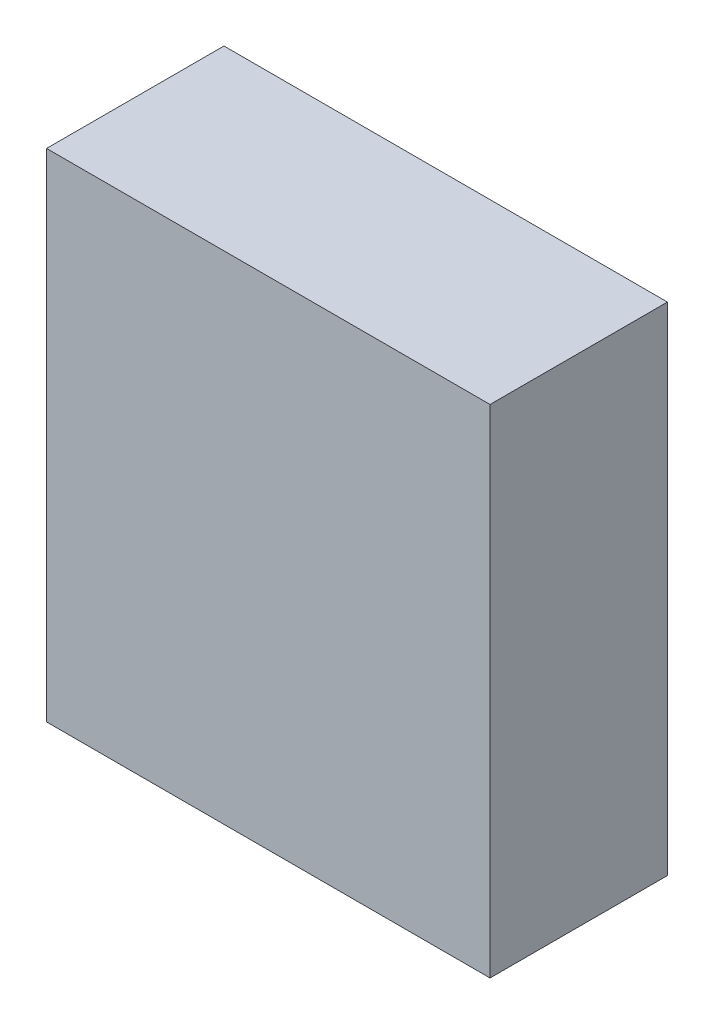
ISO-10303-21;
HEADER;
FILE_DESCRIPTION(('STEP AP214'),'2;1');
FILE_NAME('part.step','',(''),(''),'','','');
FILE_SCHEMA(('AUTOMOTIVE_DESIGN { 1 0 10303 214 1 1 1 1 }'));
ENDSEC;
DATA;
#1=APPLICATION_CONTEXT('core data for automotive mechanical design processes');
#2=APPLICATION_PROTOCOL_DEFINITION('international standard','automotive_design',2000,#1);
#3=PRODUCT_CONTEXT('',#1,'mechanical');
#4=PRODUCT('Part','Part','',(#3));
#5=PRODUCT_RELATED_PRODUCT_CATEGORY('part','',(#4));
#6=PRODUCT_DEFINITION_FORMATION('','',#4);
#7=PRODUCT_DEFINITION_CONTEXT('part definition',#1,'design');
#8=PRODUCT_DEFINITION('design','',#6,#7);
#9=PRODUCT_DEFINITION_SHAPE('','',#8);
#10=(LENGTH_UNIT() NAMED_UNIT(*) SI_UNIT(.MILLI.,.METRE.));
#11=(NAMED_UNIT(*) PLANE_ANGLE_UNIT() SI_UNIT($,.RADIAN.));
#12=(NAMED_UNIT(*) SI_UNIT($,.STERADIAN.) SOLID_ANGLE_UNIT());
#13=UNCERTAINTY_MEASURE_WITH_UNIT(LENGTH_MEASURE(1.E-05),#10,'distance_accuracy_value','');
#14=(GEOMETRIC_REPRESENTATION_CONTEXT(3) GLOBAL_UNCERTAINTY_ASSIGNED_CONTEXT((#13)) GLOBAL_UNIT_ASSIGNED_CONTEXT((#10,
#11,#12)) REPRESENTATION_CONTEXT('',''));
#15=CARTESIAN_POINT('',(0.,0.,0.));
#16=DIRECTION('',(0.,0.,1.));
#17=DIRECTION('',(1.,0.,0.));
#18=AXIS2_PLACEMENT_3D('',#15,#16,#17);
#19=CARTESIAN_POINT('',(125.,-140.,100.));
#20=DIRECTION('',(-1.,0.,0.));
#21=DIRECTION('',(0.,0.,1.));
#22=AXIS2_PLACEMENT_3D('',#19,#20,#21);
#23=PLANE('',#22);
#24=DIRECTION('',(0.,1.,0.));
#25=VECTOR('',#24,1.);
#26=CARTESIAN_POINT('',(125.,-140.,0.));
#27=LINE('',#26,#25);
#28=CARTESIAN_POINT('',(125.,-140.,0.));
#29=VERTEX_POINT('',#28);
#30=CARTESIAN_POINT('',(125.,140.,0.));
#31=VERTEX_POINT('',#30);
#32=EDGE_CURVE('E98',#29,#31,#27,.T.);
#33=ORIENTED_EDGE('',*,*,#32,.T.);
#34=DIRECTION('',(0.,0.,-1.));
#35=VECTOR('',#34,1.);
#36=CARTESIAN_POINT('',(125.,140.,100.));
#37=LINE('',#36,#35);
#38=CARTESIAN_POINT('',(125.,140.,100.));
#39=VERTEX_POINT('',#38);
#40=EDGE_CURVE('E11',#39,#31,#37,.T.);
#41=ORIENTED_EDGE('',*,*,#40,.F.);
#42=DIRECTION('',(0.,1.,0.));
#43=VECTOR('',#42,1.);
#44=CARTESIAN_POINT('',(125.,-140.,100.));
#45=LINE('',#44,#43);
#46=CARTESIAN_POINT('',(125.,-140.,100.));
#47=VERTEX_POINT('',#46);
#48=EDGE_CURVE('E86',#47,#39,#45,.T.);
#49=ORIENTED_EDGE('',*,*,#48,.F.);
#50=DIRECTION('',(0.,0.,-1.));
#51=VECTOR('',#50,1.);
#52=CARTESIAN_POINT('',(125.,-140.,100.));
#53=LINE('',#52,#51);
#54=EDGE_CURVE('E94',#47,#29,#53,.T.);
#55=ORIENTED_EDGE('',*,*,#54,.T.);
#56=EDGE_LOOP('',(#33,#41,#49,#55));
#57=FACE_BOUND('',#56,.T.);
#58=ADVANCED_FACE('F35',(#57),#23,.F.);
#59=CARTESIAN_POINT('',(-125.,140.,100.));
#60=DIRECTION('',(0.,-1.,0.));
#61=DIRECTION('',(0.,0.,-1.));
#62=AXIS2_PLACEMENT_3D('',#59,#60,#61);
#63=PLANE('',#62);
#64=DIRECTION('',(-1.,0.,0.));
#65=VECTOR('',#64,1.);
#66=CARTESIAN_POINT('',(-125.,140.,0.));
#67=LINE('',#66,#65);
#68=CARTESIAN_POINT('',(-125.,140.,0.));
#69=VERTEX_POINT('',#68);
#70=EDGE_CURVE('E90',#31,#69,#67,.T.);
#71=ORIENTED_EDGE('',*,*,#70,.T.);
#72=DIRECTION('',(0.,0.,-1.));
#73=VECTOR('',#72,1.);
#74=CARTESIAN_POINT('',(-125.,140.,100.));
#75=LINE('',#74,#73);
#76=CARTESIAN_POINT('',(-125.,140.,100.));
#77=VERTEX_POINT('',#76);
#78=EDGE_CURVE('E43',#77,#69,#75,.T.);
#79=ORIENTED_EDGE('',*,*,#78,.F.);
#80=DIRECTION('',(-1.,0.,0.));
#81=VECTOR('',#80,1.);
#82=CARTESIAN_POINT('',(-125.,140.,100.));
#83=LINE('',#82,#81);
#84=EDGE_CURVE('E81',#39,#77,#83,.T.);
#85=ORIENTED_EDGE('',*,*,#84,.F.);
#86=ORIENTED_EDGE('',*,*,#40,.T.);
#87=EDGE_LOOP('',(#71,#79,#85,#86));
#88=FACE_BOUND('',#87,.T.);
#89=ADVANCED_FACE('F89',(#88),#63,.F.);
#90=CARTESIAN_POINT('',(-125.,-140.,100.));
#91=DIRECTION('',(1.,0.,0.));
#92=DIRECTION('',(0.,0.,-1.));
#93=AXIS2_PLACEMENT_3D('',#90,#91,#92);
#94=PLANE('',#93);
#95=DIRECTION('',(0.,-1.,0.));
#96=VECTOR('',#95,1.);
#97=CARTESIAN_POINT('',(-125.,-140.,0.));
#98=LINE('',#97,#96);
#99=CARTESIAN_POINT('',(-125.,-140.,0.));
#100=VERTEX_POINT('',#99);
#101=EDGE_CURVE('E68',#69,#100,#98,.T.);
#102=ORIENTED_EDGE('',*,*,#101,.T.);
#103=DIRECTION('',(0.,0.,-1.));
#104=VECTOR('',#103,1.);
#105=CARTESIAN_POINT('',(-125.,-140.,100.));
#106=LINE('',#105,#104);
#107=CARTESIAN_POINT('',(-125.,-140.,100.));
#108=VERTEX_POINT('',#107);
#109=EDGE_CURVE('E91',#108,#100,#106,.T.);
#110=ORIENTED_EDGE('',*,*,#109,.F.);
#111=DIRECTION('',(0.,-1.,0.));
#112=VECTOR('',#111,1.);
#113=CARTESIAN_POINT('',(-125.,-140.,100.));
#114=LINE('',#113,#112);
#115=EDGE_CURVE('E84',#77,#108,#114,.T.);
#116=ORIENTED_EDGE('',*,*,#115,.F.);
#117=ORIENTED_EDGE('',*,*,#78,.T.);
#118=EDGE_LOOP('',(#102,#110,#116,#117));
#119=FACE_BOUND('',#118,.T.);
#120=ADVANCED_FACE('F92',(#119),#94,.F.);
#121=CARTESIAN_POINT('',(-125.,-140.,100.));
#122=DIRECTION('',(0.,1.,0.));
#123=DIRECTION('',(0.,0.,1.));
#124=AXIS2_PLACEMENT_3D('',#121,#122,#123);
#125=PLANE('',#124);
#126=DIRECTION('',(1.,0.,0.));
#127=VECTOR('',#126,1.);
#128=CARTESIAN_POINT('',(-125.,-140.,0.));
#129=LINE('',#128,#127);
#130=EDGE_CURVE('E74',#100,#29,#129,.T.);
#131=ORIENTED_EDGE('',*,*,#130,.T.);
#132=ORIENTED_EDGE('',*,*,#54,.F.);
#133=DIRECTION('',(1.,0.,0.));
#134=VECTOR('',#133,1.);
#135=CARTESIAN_POINT('',(-125.,-140.,100.));
#136=LINE('',#135,#134);
#137=EDGE_CURVE('E51',#108,#47,#136,.T.);
#138=ORIENTED_EDGE('',*,*,#137,.F.);
#139=ORIENTED_EDGE('',*,*,#109,.T.);
#140=EDGE_LOOP('',(#131,#132,#138,#139));
#141=FACE_BOUND('',#140,.T.);
#142=ADVANCED_FACE('F105',(#141),#125,.F.);
#143=CARTESIAN_POINT('',(0.,0.,100.));
#144=DIRECTION('',(0.,0.,-1.));
#145=DIRECTION('',(-1.,0.,0.));
#146=AXIS2_PLACEMENT_3D('',#143,#144,#145);
#147=PLANE('',#146);
#148=ORIENTED_EDGE('',*,*,#48,.T.);
#149=ORIENTED_EDGE('',*,*,#84,.T.);
#150=ORIENTED_EDGE('',*,*,#115,.T.);
#151=ORIENTED_EDGE('',*,*,#137,.T.);
#152=EDGE_LOOP('',(#148,#149,#150,#151));
#153=FACE_BOUND('',#152,.T.);
#154=ADVANCED_FACE('F82',(#153),#147,.F.);
#155=CARTESIAN_POINT('',(0.,0.,0.));
#156=DIRECTION('',(0.,0.,-1.));
#157=DIRECTION('',(-1.,0.,0.));
#158=AXIS2_PLACEMENT_3D('',#155,#156,#157);
#159=PLANE('',#158);
#160=ORIENTED_EDGE('',*,*,#32,.F.);
#161=ORIENTED_EDGE('',*,*,#130,.F.);
#162=ORIENTED_EDGE('',*,*,#101,.F.);
#163=ORIENTED_EDGE('',*,*,#70,.F.);
#164=EDGE_LOOP('',(#160,#161,#162,#163));
#165=FACE_BOUND('',#164,.T.);
#166=ADVANCED_FACE('F108',(#165),#159,.T.);
#167=CLOSED_SHELL('',(#58,#89,#120,#142,#154,#166));
#168=MANIFOLD_SOLID_BREP('B2',#167);
#169=ADVANCED_BREP_SHAPE_REPRESENTATION('',(#18,#168),#14);
#170=SHAPE_DEFINITION_REPRESENTATION(#9,#169);
ENDSEC;
END-ISO-10303-21;
